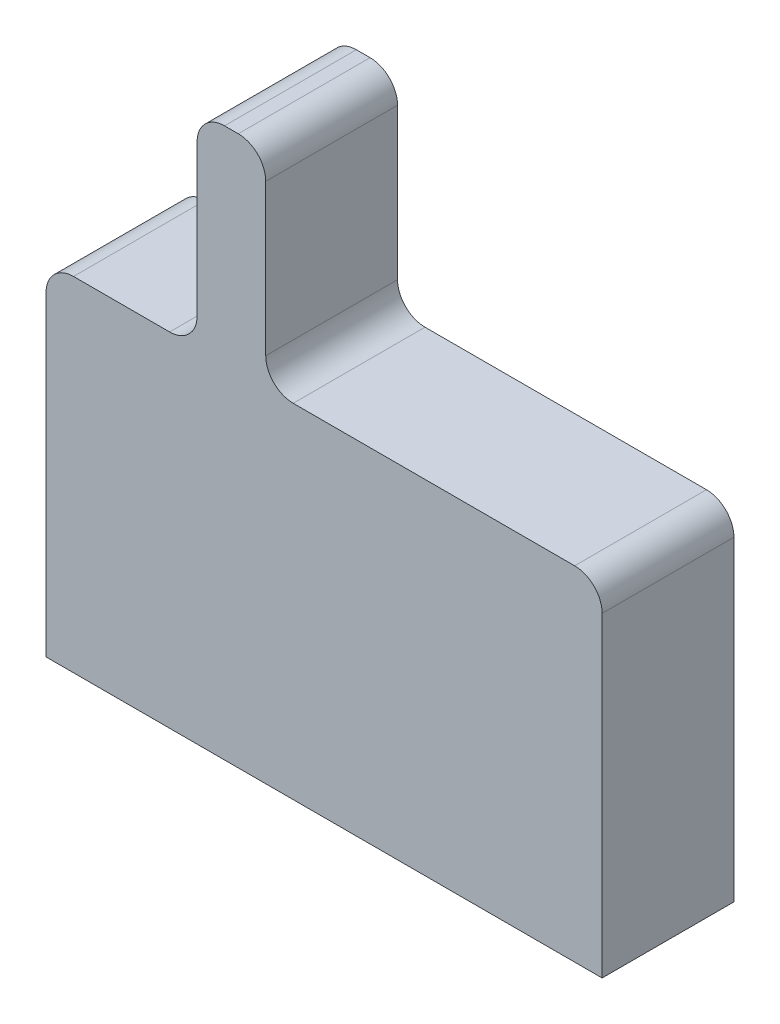
ISO-10303-21;
HEADER;
FILE_DESCRIPTION(('STEP AP214'),'2;1');
FILE_NAME('part.step','',(''),(''),'','','');
FILE_SCHEMA(('AUTOMOTIVE_DESIGN { 1 0 10303 214 1 1 1 1 }'));
ENDSEC;
DATA;
#1=APPLICATION_CONTEXT('core data for automotive mechanical design processes');
#2=APPLICATION_PROTOCOL_DEFINITION('international standard','automotive_design',2000,#1);
#3=PRODUCT_CONTEXT('',#1,'mechanical');
#4=PRODUCT('Part','Part','',(#3));
#5=PRODUCT_RELATED_PRODUCT_CATEGORY('part','',(#4));
#6=PRODUCT_DEFINITION_FORMATION('','',#4);
#7=PRODUCT_DEFINITION_CONTEXT('part definition',#1,'design');
#8=PRODUCT_DEFINITION('design','',#6,#7);
#9=PRODUCT_DEFINITION_SHAPE('','',#8);
#10=(LENGTH_UNIT() NAMED_UNIT(*) SI_UNIT(.MILLI.,.METRE.));
#11=(NAMED_UNIT(*) PLANE_ANGLE_UNIT() SI_UNIT($,.RADIAN.));
#12=(NAMED_UNIT(*) SI_UNIT($,.STERADIAN.) SOLID_ANGLE_UNIT());
#13=UNCERTAINTY_MEASURE_WITH_UNIT(LENGTH_MEASURE(1.E-05),#10,'distance_accuracy_value','');
#14=(GEOMETRIC_REPRESENTATION_CONTEXT(3) GLOBAL_UNCERTAINTY_ASSIGNED_CONTEXT((#13)) GLOBAL_UNIT_ASSIGNED_CONTEXT((#10,
#11,#12)) REPRESENTATION_CONTEXT('',''));
#15=CARTESIAN_POINT('',(0.,0.,0.));
#16=DIRECTION('',(0.,0.,1.));
#17=DIRECTION('',(1.,0.,0.));
#18=AXIS2_PLACEMENT_3D('',#15,#16,#17);
#19=CARTESIAN_POINT('',(2.025,1.25,0.96));
#20=DIRECTION('',(-1.,0.,0.));
#21=DIRECTION('',(0.,0.,1.));
#22=AXIS2_PLACEMENT_3D('',#19,#20,#21);
#23=PLANE('',#22);
#24=DIRECTION('',(0.,1.,0.));
#25=VECTOR('',#24,1.);
#26=CARTESIAN_POINT('',(2.025,1.25,0.));
#27=LINE('',#26,#25);
#28=CARTESIAN_POINT('',(2.025,-1.25,0.));
#29=VERTEX_POINT('',#28);
#30=CARTESIAN_POINT('',(2.025,1.05,0.));
#31=VERTEX_POINT('',#30);
#32=EDGE_CURVE('E162',#29,#31,#27,.T.);
#33=ORIENTED_EDGE('',*,*,#32,.T.);
#34=DIRECTION('',(0.,0.,-1.));
#35=VECTOR('',#34,1.);
#36=CARTESIAN_POINT('',(2.025,1.05,0.96));
#37=LINE('',#36,#35);
#38=CARTESIAN_POINT('',(2.025,1.05,0.96));
#39=VERTEX_POINT('',#38);
#40=EDGE_CURVE('E217',#31,#39,#37,.F.);
#41=ORIENTED_EDGE('',*,*,#40,.T.);
#42=DIRECTION('',(0.,1.,0.));
#43=VECTOR('',#42,1.);
#44=CARTESIAN_POINT('',(2.025,1.25,0.96));
#45=LINE('',#44,#43);
#46=CARTESIAN_POINT('',(2.025,-1.25,0.96));
#47=VERTEX_POINT('',#46);
#48=EDGE_CURVE('E181',#47,#39,#45,.T.);
#49=ORIENTED_EDGE('',*,*,#48,.F.);
#50=DIRECTION('',(0.,0.,-1.));
#51=VECTOR('',#50,1.);
#52=CARTESIAN_POINT('',(2.025,-1.25,0.96));
#53=LINE('',#52,#51);
#54=EDGE_CURVE('E153',#47,#29,#53,.T.);
#55=ORIENTED_EDGE('',*,*,#54,.T.);
#56=EDGE_LOOP('',(#33,#41,#49,#55));
#57=FACE_BOUND('',#56,.T.);
#58=ADVANCED_FACE('F33',(#57),#23,.F.);
#59=CARTESIAN_POINT('',(-0.424999999999999,1.25,0.96));
#60=DIRECTION('',(0.,-1.,0.));
#61=DIRECTION('',(1.,0.,0.));
#62=AXIS2_PLACEMENT_3D('',#59,#60,#61);
#63=PLANE('',#62);
#64=DIRECTION('',(-1.,0.,0.));
#65=VECTOR('',#64,1.);
#66=CARTESIAN_POINT('',(-0.424999999999999,1.25,0.96));
#67=LINE('',#66,#65);
#68=CARTESIAN_POINT('',(1.825,1.25,0.96));
#69=VERTEX_POINT('',#68);
#70=CARTESIAN_POINT('',(-0.225,1.25,0.96));
#71=VERTEX_POINT('',#70);
#72=EDGE_CURVE('E245',#69,#71,#67,.T.);
#73=ORIENTED_EDGE('',*,*,#72,.F.);
#74=DIRECTION('',(0.,0.,-1.));
#75=VECTOR('',#74,1.);
#76=CARTESIAN_POINT('',(1.825,1.25,0.96));
#77=LINE('',#76,#75);
#78=CARTESIAN_POINT('',(1.825,1.25,0.));
#79=VERTEX_POINT('',#78);
#80=EDGE_CURVE('E214',#69,#79,#77,.T.);
#81=ORIENTED_EDGE('',*,*,#80,.T.);
#82=DIRECTION('',(-1.,0.,0.));
#83=VECTOR('',#82,1.);
#84=CARTESIAN_POINT('',(-0.424999999999999,1.25,0.));
#85=LINE('',#84,#83);
#86=CARTESIAN_POINT('',(-0.225,1.25,0.));
#87=VERTEX_POINT('',#86);
#88=EDGE_CURVE('E165',#79,#87,#85,.T.);
#89=ORIENTED_EDGE('',*,*,#88,.T.);
#90=DIRECTION('',(0.,0.,-1.));
#91=VECTOR('',#90,1.);
#92=CARTESIAN_POINT('',(-0.225,1.25,0.96));
#93=LINE('',#92,#91);
#94=EDGE_CURVE('E212',#87,#71,#93,.F.);
#95=ORIENTED_EDGE('',*,*,#94,.T.);
#96=EDGE_LOOP('',(#73,#81,#89,#95));
#97=FACE_BOUND('',#96,.T.);
#98=ADVANCED_FACE('F238',(#97),#63,.F.);
#99=CARTESIAN_POINT('',(-0.425,2.75,0.96));
#100=DIRECTION('',(-1.,0.,0.));
#101=DIRECTION('',(0.,-1.,0.));
#102=AXIS2_PLACEMENT_3D('',#99,#100,#101);
#103=PLANE('',#102);
#104=DIRECTION('',(0.,1.,0.));
#105=VECTOR('',#104,1.);
#106=CARTESIAN_POINT('',(-0.425,2.75,0.));
#107=LINE('',#106,#105);
#108=CARTESIAN_POINT('',(-0.425,1.45,0.));
#109=VERTEX_POINT('',#108);
#110=CARTESIAN_POINT('',(-0.425,2.55,0.));
#111=VERTEX_POINT('',#110);
#112=EDGE_CURVE('E168',#109,#111,#107,.T.);
#113=ORIENTED_EDGE('',*,*,#112,.T.);
#114=DIRECTION('',(0.,0.,-1.));
#115=VECTOR('',#114,1.);
#116=CARTESIAN_POINT('',(-0.425,2.55,0.96));
#117=LINE('',#116,#115);
#118=CARTESIAN_POINT('',(-0.425,2.55,0.96));
#119=VERTEX_POINT('',#118);
#120=EDGE_CURVE('E198',#111,#119,#117,.F.);
#121=ORIENTED_EDGE('',*,*,#120,.T.);
#122=DIRECTION('',(0.,1.,0.));
#123=VECTOR('',#122,1.);
#124=CARTESIAN_POINT('',(-0.425,2.75,0.96));
#125=LINE('',#124,#123);
#126=CARTESIAN_POINT('',(-0.425,1.45,0.96));
#127=VERTEX_POINT('',#126);
#128=EDGE_CURVE('E243',#127,#119,#125,.T.);
#129=ORIENTED_EDGE('',*,*,#128,.F.);
#130=DIRECTION('',(0.,0.,-1.));
#131=VECTOR('',#130,1.);
#132=CARTESIAN_POINT('',(-0.425,1.45,0.));
#133=LINE('',#132,#131);
#134=EDGE_CURVE('E195',#127,#109,#133,.T.);
#135=ORIENTED_EDGE('',*,*,#134,.T.);
#136=EDGE_LOOP('',(#113,#121,#129,#135));
#137=FACE_BOUND('',#136,.T.);
#138=ADVANCED_FACE('F247',(#137),#103,.F.);
#139=CARTESIAN_POINT('',(-0.925,2.75,0.96));
#140=DIRECTION('',(0.,-1.,0.));
#141=DIRECTION('',(0.,0.,-1.));
#142=AXIS2_PLACEMENT_3D('',#139,#140,#141);
#143=PLANE('',#142);
#144=DIRECTION('',(-1.,0.,0.));
#145=VECTOR('',#144,1.);
#146=CARTESIAN_POINT('',(-0.925,2.75,0.96));
#147=LINE('',#146,#145);
#148=CARTESIAN_POINT('',(-0.625,2.75,0.96));
#149=VERTEX_POINT('',#148);
#150=CARTESIAN_POINT('',(-0.725,2.75,0.96));
#151=VERTEX_POINT('',#150);
#152=EDGE_CURVE('E249',#149,#151,#147,.T.);
#153=ORIENTED_EDGE('',*,*,#152,.F.);
#154=DIRECTION('',(0.,0.,-1.));
#155=VECTOR('',#154,1.);
#156=CARTESIAN_POINT('',(-0.625,2.75,0.96));
#157=LINE('',#156,#155);
#158=CARTESIAN_POINT('',(-0.625,2.75,0.));
#159=VERTEX_POINT('',#158);
#160=EDGE_CURVE('E184',#149,#159,#157,.T.);
#161=ORIENTED_EDGE('',*,*,#160,.T.);
#162=DIRECTION('',(-1.,0.,0.));
#163=VECTOR('',#162,1.);
#164=CARTESIAN_POINT('',(-0.925,2.75,0.));
#165=LINE('',#164,#163);
#166=CARTESIAN_POINT('',(-0.725,2.75,0.));
#167=VERTEX_POINT('',#166);
#168=EDGE_CURVE('E171',#159,#167,#165,.T.);
#169=ORIENTED_EDGE('',*,*,#168,.T.);
#170=DIRECTION('',(0.,0.,-1.));
#171=VECTOR('',#170,1.);
#172=CARTESIAN_POINT('',(-0.725,2.75,0.96));
#173=LINE('',#172,#171);
#174=EDGE_CURVE('E152',#167,#151,#173,.F.);
#175=ORIENTED_EDGE('',*,*,#174,.T.);
#176=EDGE_LOOP('',(#153,#161,#169,#175));
#177=FACE_BOUND('',#176,.T.);
#178=ADVANCED_FACE('F299',(#177),#143,.F.);
#179=CARTESIAN_POINT('',(-0.925,1.25,0.96));
#180=DIRECTION('',(1.,0.,0.));
#181=DIRECTION('',(0.,0.,-1.));
#182=AXIS2_PLACEMENT_3D('',#179,#180,#181);
#183=PLANE('',#182);
#184=DIRECTION('',(0.,-1.,0.));
#185=VECTOR('',#184,1.);
#186=CARTESIAN_POINT('',(-0.925,1.25,0.96));
#187=LINE('',#186,#185);
#188=CARTESIAN_POINT('',(-0.925,2.55,0.96));
#189=VERTEX_POINT('',#188);
#190=CARTESIAN_POINT('',(-0.925,1.45,0.96));
#191=VERTEX_POINT('',#190);
#192=EDGE_CURVE('E252',#189,#191,#187,.T.);
#193=ORIENTED_EDGE('',*,*,#192,.F.);
#194=DIRECTION('',(0.,0.,-1.));
#195=VECTOR('',#194,1.);
#196=CARTESIAN_POINT('',(-0.925,2.55,0.96));
#197=LINE('',#196,#195);
#198=CARTESIAN_POINT('',(-0.925,2.55,0.));
#199=VERTEX_POINT('',#198);
#200=EDGE_CURVE('E209',#189,#199,#197,.T.);
#201=ORIENTED_EDGE('',*,*,#200,.T.);
#202=DIRECTION('',(0.,-1.,0.));
#203=VECTOR('',#202,1.);
#204=CARTESIAN_POINT('',(-0.925,1.25,0.));
#205=LINE('',#204,#203);
#206=CARTESIAN_POINT('',(-0.925,1.45,0.));
#207=VERTEX_POINT('',#206);
#208=EDGE_CURVE('E174',#199,#207,#205,.T.);
#209=ORIENTED_EDGE('',*,*,#208,.T.);
#210=DIRECTION('',(0.,0.,-1.));
#211=VECTOR('',#210,1.);
#212=CARTESIAN_POINT('',(-0.925,1.45,0.96));
#213=LINE('',#212,#211);
#214=EDGE_CURVE('E207',#207,#191,#213,.F.);
#215=ORIENTED_EDGE('',*,*,#214,.T.);
#216=EDGE_LOOP('',(#193,#201,#209,#215));
#217=FACE_BOUND('',#216,.T.);
#218=ADVANCED_FACE('F304',(#217),#183,.F.);
#219=CARTESIAN_POINT('',(-2.025,1.25,0.96));
#220=DIRECTION('',(0.,-1.,0.));
#221=DIRECTION('',(1.,0.,0.));
#222=AXIS2_PLACEMENT_3D('',#219,#220,#221);
#223=PLANE('',#222);
#224=DIRECTION('',(-1.,0.,0.));
#225=VECTOR('',#224,1.);
#226=CARTESIAN_POINT('',(-2.025,1.25,0.));
#227=LINE('',#226,#225);
#228=CARTESIAN_POINT('',(-1.125,1.25,0.));
#229=VERTEX_POINT('',#228);
#230=CARTESIAN_POINT('',(-1.825,1.25,0.));
#231=VERTEX_POINT('',#230);
#232=EDGE_CURVE('E177',#229,#231,#227,.T.);
#233=ORIENTED_EDGE('',*,*,#232,.T.);
#234=DIRECTION('',(0.,0.,-1.));
#235=VECTOR('',#234,1.);
#236=CARTESIAN_POINT('',(-1.825,1.25,0.96));
#237=LINE('',#236,#235);
#238=CARTESIAN_POINT('',(-1.825,1.25,0.96));
#239=VERTEX_POINT('',#238);
#240=EDGE_CURVE('E56',#231,#239,#237,.F.);
#241=ORIENTED_EDGE('',*,*,#240,.T.);
#242=DIRECTION('',(-1.,0.,0.));
#243=VECTOR('',#242,1.);
#244=CARTESIAN_POINT('',(-2.025,1.25,0.96));
#245=LINE('',#244,#243);
#246=CARTESIAN_POINT('',(-1.125,1.25,0.96));
#247=VERTEX_POINT('',#246);
#248=EDGE_CURVE('E143',#247,#239,#245,.T.);
#249=ORIENTED_EDGE('',*,*,#248,.F.);
#250=DIRECTION('',(0.,0.,-1.));
#251=VECTOR('',#250,1.);
#252=CARTESIAN_POINT('',(-1.125,1.25,0.));
#253=LINE('',#252,#251);
#254=EDGE_CURVE('E221',#247,#229,#253,.T.);
#255=ORIENTED_EDGE('',*,*,#254,.T.);
#256=EDGE_LOOP('',(#233,#241,#249,#255));
#257=FACE_BOUND('',#256,.T.);
#258=ADVANCED_FACE('F308',(#257),#223,.F.);
#259=CARTESIAN_POINT('',(-2.025,1.25,0.96));
#260=DIRECTION('',(1.,0.,0.));
#261=DIRECTION('',(0.,1.,0.));
#262=AXIS2_PLACEMENT_3D('',#259,#260,#261);
#263=PLANE('',#262);
#264=DIRECTION('',(0.,-1.,0.));
#265=VECTOR('',#264,1.);
#266=CARTESIAN_POINT('',(-2.025,1.25,0.96));
#267=LINE('',#266,#265);
#268=CARTESIAN_POINT('',(-2.025,1.05,0.96));
#269=VERTEX_POINT('',#268);
#270=CARTESIAN_POINT('',(-2.025,-1.25,0.96));
#271=VERTEX_POINT('',#270);
#272=EDGE_CURVE('E132',#269,#271,#267,.T.);
#273=ORIENTED_EDGE('',*,*,#272,.F.);
#274=DIRECTION('',(0.,0.,-1.));
#275=VECTOR('',#274,1.);
#276=CARTESIAN_POINT('',(-2.025,1.05,0.96));
#277=LINE('',#276,#275);
#278=CARTESIAN_POINT('',(-2.025,1.05,0.));
#279=VERTEX_POINT('',#278);
#280=EDGE_CURVE('E219',#269,#279,#277,.T.);
#281=ORIENTED_EDGE('',*,*,#280,.T.);
#282=DIRECTION('',(0.,-1.,0.));
#283=VECTOR('',#282,1.);
#284=CARTESIAN_POINT('',(-2.025,1.25,0.));
#285=LINE('',#284,#283);
#286=CARTESIAN_POINT('',(-2.025,-1.25,0.));
#287=VERTEX_POINT('',#286);
#288=EDGE_CURVE('E149',#279,#287,#285,.T.);
#289=ORIENTED_EDGE('',*,*,#288,.T.);
#290=DIRECTION('',(0.,0.,-1.));
#291=VECTOR('',#290,1.);
#292=CARTESIAN_POINT('',(-2.025,-1.25,0.96));
#293=LINE('',#292,#291);
#294=EDGE_CURVE('E146',#271,#287,#293,.T.);
#295=ORIENTED_EDGE('',*,*,#294,.F.);
#296=EDGE_LOOP('',(#273,#281,#289,#295));
#297=FACE_BOUND('',#296,.T.);
#298=ADVANCED_FACE('F147',(#297),#263,.F.);
#299=CARTESIAN_POINT('',(-2.025,-1.25,0.96));
#300=DIRECTION('',(0.,1.,0.));
#301=DIRECTION('',(0.,0.,1.));
#302=AXIS2_PLACEMENT_3D('',#299,#300,#301);
#303=PLANE('',#302);
#304=DIRECTION('',(1.,0.,0.));
#305=VECTOR('',#304,1.);
#306=CARTESIAN_POINT('',(-2.025,-1.25,0.));
#307=LINE('',#306,#305);
#308=EDGE_CURVE('E180',#287,#29,#307,.T.);
#309=ORIENTED_EDGE('',*,*,#308,.T.);
#310=ORIENTED_EDGE('',*,*,#54,.F.);
#311=DIRECTION('',(1.,0.,0.));
#312=VECTOR('',#311,1.);
#313=CARTESIAN_POINT('',(-2.025,-1.25,0.96));
#314=LINE('',#313,#312);
#315=EDGE_CURVE('E138',#271,#47,#314,.T.);
#316=ORIENTED_EDGE('',*,*,#315,.F.);
#317=ORIENTED_EDGE('',*,*,#294,.T.);
#318=EDGE_LOOP('',(#309,#310,#316,#317));
#319=FACE_BOUND('',#318,.T.);
#320=ADVANCED_FACE('F155',(#319),#303,.F.);
#321=CARTESIAN_POINT('',(0.,0.,0.96));
#322=DIRECTION('',(0.,0.,1.));
#323=DIRECTION('',(1.,0.,0.));
#324=AXIS2_PLACEMENT_3D('',#321,#322,#323);
#325=PLANE('',#324);
#326=ORIENTED_EDGE('',*,*,#128,.T.);
#327=CARTESIAN_POINT('',(-0.625,2.55,0.96));
#328=DIRECTION('',(0.,0.,1.));
#329=DIRECTION('',(1.,0.,0.));
#330=AXIS2_PLACEMENT_3D('',#327,#328,#329);
#331=CIRCLE('',#330,0.2);
#332=EDGE_CURVE('E205',#119,#149,#331,.T.);
#333=ORIENTED_EDGE('',*,*,#332,.T.);
#334=ORIENTED_EDGE('',*,*,#152,.T.);
#335=CARTESIAN_POINT('',(-0.725,2.55,0.96));
#336=DIRECTION('',(0.,0.,1.));
#337=DIRECTION('',(1.,0.,0.));
#338=AXIS2_PLACEMENT_3D('',#335,#336,#337);
#339=CIRCLE('',#338,0.2);
#340=EDGE_CURVE('E203',#151,#189,#339,.T.);
#341=ORIENTED_EDGE('',*,*,#340,.T.);
#342=ORIENTED_EDGE('',*,*,#192,.T.);
#343=CARTESIAN_POINT('',(-1.125,1.45,0.96));
#344=DIRECTION('',(0.,0.,1.));
#345=DIRECTION('',(1.,0.,0.));
#346=AXIS2_PLACEMENT_3D('',#343,#344,#345);
#347=CIRCLE('',#346,0.2);
#348=EDGE_CURVE('E227',#191,#247,#347,.F.);
#349=ORIENTED_EDGE('',*,*,#348,.T.);
#350=ORIENTED_EDGE('',*,*,#248,.T.);
#351=CARTESIAN_POINT('',(-1.825,1.05,0.96));
#352=DIRECTION('',(0.,0.,1.));
#353=DIRECTION('',(1.,0.,0.));
#354=AXIS2_PLACEMENT_3D('',#351,#352,#353);
#355=CIRCLE('',#354,0.2);
#356=EDGE_CURVE('E48',#239,#269,#355,.T.);
#357=ORIENTED_EDGE('',*,*,#356,.T.);
#358=ORIENTED_EDGE('',*,*,#272,.T.);
#359=ORIENTED_EDGE('',*,*,#315,.T.);
#360=ORIENTED_EDGE('',*,*,#48,.T.);
#361=CARTESIAN_POINT('',(1.825,1.05,0.96));
#362=DIRECTION('',(0.,0.,1.));
#363=DIRECTION('',(1.,0.,0.));
#364=AXIS2_PLACEMENT_3D('',#361,#362,#363);
#365=CIRCLE('',#364,0.2);
#366=EDGE_CURVE('E201',#39,#69,#365,.T.);
#367=ORIENTED_EDGE('',*,*,#366,.T.);
#368=ORIENTED_EDGE('',*,*,#72,.T.);
#369=CARTESIAN_POINT('',(-0.225,1.45,0.96));
#370=DIRECTION('',(0.,0.,1.));
#371=DIRECTION('',(1.,0.,0.));
#372=AXIS2_PLACEMENT_3D('',#369,#370,#371);
#373=CIRCLE('',#372,0.2);
#374=EDGE_CURVE('E11',#71,#127,#373,.F.);
#375=ORIENTED_EDGE('',*,*,#374,.T.);
#376=EDGE_LOOP('',(#326,#333,#334,#341,#342,#349,#350,#357,#358,#359,#360,#367,#368,#375));
#377=FACE_BOUND('',#376,.T.);
#378=ADVANCED_FACE('F135',(#377),#325,.T.);
#379=CARTESIAN_POINT('',(0.,0.,0.));
#380=DIRECTION('',(0.,0.,1.));
#381=DIRECTION('',(1.,0.,0.));
#382=AXIS2_PLACEMENT_3D('',#379,#380,#381);
#383=PLANE('',#382);
#384=ORIENTED_EDGE('',*,*,#168,.F.);
#385=CARTESIAN_POINT('',(-0.625,2.55,0.));
#386=DIRECTION('',(0.,0.,1.));
#387=DIRECTION('',(1.,0.,0.));
#388=AXIS2_PLACEMENT_3D('',#385,#386,#387);
#389=CIRCLE('',#388,0.2);
#390=EDGE_CURVE('E193',#159,#111,#389,.F.);
#391=ORIENTED_EDGE('',*,*,#390,.T.);
#392=ORIENTED_EDGE('',*,*,#112,.F.);
#393=CARTESIAN_POINT('',(-0.225,1.45,0.));
#394=DIRECTION('',(0.,0.,1.));
#395=DIRECTION('',(1.,0.,0.));
#396=AXIS2_PLACEMENT_3D('',#393,#394,#395);
#397=CIRCLE('',#396,0.2);
#398=EDGE_CURVE('E41',#109,#87,#397,.T.);
#399=ORIENTED_EDGE('',*,*,#398,.T.);
#400=ORIENTED_EDGE('',*,*,#88,.F.);
#401=CARTESIAN_POINT('',(1.825,1.05,0.));
#402=DIRECTION('',(0.,0.,1.));
#403=DIRECTION('',(1.,0.,0.));
#404=AXIS2_PLACEMENT_3D('',#401,#402,#403);
#405=CIRCLE('',#404,0.2);
#406=EDGE_CURVE('E189',#79,#31,#405,.F.);
#407=ORIENTED_EDGE('',*,*,#406,.T.);
#408=ORIENTED_EDGE('',*,*,#32,.F.);
#409=ORIENTED_EDGE('',*,*,#308,.F.);
#410=ORIENTED_EDGE('',*,*,#288,.F.);
#411=CARTESIAN_POINT('',(-1.825,1.05,0.));
#412=DIRECTION('',(0.,0.,1.));
#413=DIRECTION('',(1.,0.,0.));
#414=AXIS2_PLACEMENT_3D('',#411,#412,#413);
#415=CIRCLE('',#414,0.2);
#416=EDGE_CURVE('E187',#279,#231,#415,.F.);
#417=ORIENTED_EDGE('',*,*,#416,.T.);
#418=ORIENTED_EDGE('',*,*,#232,.F.);
#419=CARTESIAN_POINT('',(-1.125,1.45,0.));
#420=DIRECTION('',(0.,0.,1.));
#421=DIRECTION('',(1.,0.,0.));
#422=AXIS2_PLACEMENT_3D('',#419,#420,#421);
#423=CIRCLE('',#422,0.2);
#424=EDGE_CURVE('E225',#229,#207,#423,.T.);
#425=ORIENTED_EDGE('',*,*,#424,.T.);
#426=ORIENTED_EDGE('',*,*,#208,.F.);
#427=CARTESIAN_POINT('',(-0.725,2.55,0.));
#428=DIRECTION('',(0.,0.,1.));
#429=DIRECTION('',(1.,0.,0.));
#430=AXIS2_PLACEMENT_3D('',#427,#428,#429);
#431=CIRCLE('',#430,0.2);
#432=EDGE_CURVE('E191',#199,#167,#431,.F.);
#433=ORIENTED_EDGE('',*,*,#432,.T.);
#434=EDGE_LOOP('',(#384,#391,#392,#399,#400,#407,#408,#409,#410,#417,#418,#425,#426,#433));
#435=FACE_BOUND('',#434,.T.);
#436=ADVANCED_FACE('F232',(#435),#383,.F.);
#437=CARTESIAN_POINT('',(-0.625,2.55,0.96));
#438=DIRECTION('',(0.,0.,-1.));
#439=DIRECTION('',(-1.,0.,0.));
#440=AXIS2_PLACEMENT_3D('',#437,#438,#439);
#441=CYLINDRICAL_SURFACE('',#440,0.2);
#442=ORIENTED_EDGE('',*,*,#332,.F.);
#443=ORIENTED_EDGE('',*,*,#120,.F.);
#444=ORIENTED_EDGE('',*,*,#390,.F.);
#445=ORIENTED_EDGE('',*,*,#160,.F.);
#446=EDGE_LOOP('',(#442,#443,#444,#445));
#447=FACE_BOUND('',#446,.T.);
#448=ADVANCED_FACE('F278',(#447),#441,.T.);
#449=CARTESIAN_POINT('',(-0.725,2.55,0.96));
#450=DIRECTION('',(0.,0.,-1.));
#451=DIRECTION('',(-1.,0.,0.));
#452=AXIS2_PLACEMENT_3D('',#449,#450,#451);
#453=CYLINDRICAL_SURFACE('',#452,0.2);
#454=ORIENTED_EDGE('',*,*,#340,.F.);
#455=ORIENTED_EDGE('',*,*,#174,.F.);
#456=ORIENTED_EDGE('',*,*,#432,.F.);
#457=ORIENTED_EDGE('',*,*,#200,.F.);
#458=EDGE_LOOP('',(#454,#455,#456,#457));
#459=FACE_BOUND('',#458,.T.);
#460=ADVANCED_FACE('F270',(#459),#453,.T.);
#461=CARTESIAN_POINT('',(1.825,1.05,0.96));
#462=DIRECTION('',(0.,0.,-1.));
#463=DIRECTION('',(-1.,0.,0.));
#464=AXIS2_PLACEMENT_3D('',#461,#462,#463);
#465=CYLINDRICAL_SURFACE('',#464,0.2);
#466=ORIENTED_EDGE('',*,*,#366,.F.);
#467=ORIENTED_EDGE('',*,*,#40,.F.);
#468=ORIENTED_EDGE('',*,*,#406,.F.);
#469=ORIENTED_EDGE('',*,*,#80,.F.);
#470=EDGE_LOOP('',(#466,#467,#468,#469));
#471=FACE_BOUND('',#470,.T.);
#472=ADVANCED_FACE('F268',(#471),#465,.T.);
#473=CARTESIAN_POINT('',(-1.825,1.05,0.96));
#474=DIRECTION('',(0.,0.,-1.));
#475=DIRECTION('',(-1.,0.,0.));
#476=AXIS2_PLACEMENT_3D('',#473,#474,#475);
#477=CYLINDRICAL_SURFACE('',#476,0.2);
#478=ORIENTED_EDGE('',*,*,#356,.F.);
#479=ORIENTED_EDGE('',*,*,#240,.F.);
#480=ORIENTED_EDGE('',*,*,#416,.F.);
#481=ORIENTED_EDGE('',*,*,#280,.F.);
#482=EDGE_LOOP('',(#478,#479,#480,#481));
#483=FACE_BOUND('',#482,.T.);
#484=ADVANCED_FACE('F261',(#483),#477,.T.);
#485=CARTESIAN_POINT('',(-1.125,1.45,0.96));
#486=DIRECTION('',(0.,0.,1.));
#487=DIRECTION('',(1.,0.,0.));
#488=AXIS2_PLACEMENT_3D('',#485,#486,#487);
#489=CYLINDRICAL_SURFACE('',#488,0.2);
#490=ORIENTED_EDGE('',*,*,#348,.F.);
#491=ORIENTED_EDGE('',*,*,#214,.F.);
#492=ORIENTED_EDGE('',*,*,#424,.F.);
#493=ORIENTED_EDGE('',*,*,#254,.F.);
#494=EDGE_LOOP('',(#490,#491,#492,#493));
#495=FACE_BOUND('',#494,.T.);
#496=ADVANCED_FACE('F276',(#495),#489,.F.);
#497=CARTESIAN_POINT('',(-0.225,1.45,0.96));
#498=DIRECTION('',(0.,0.,1.));
#499=DIRECTION('',(1.,0.,0.));
#500=AXIS2_PLACEMENT_3D('',#497,#498,#499);
#501=CYLINDRICAL_SURFACE('',#500,0.2);
#502=ORIENTED_EDGE('',*,*,#374,.F.);
#503=ORIENTED_EDGE('',*,*,#94,.F.);
#504=ORIENTED_EDGE('',*,*,#398,.F.);
#505=ORIENTED_EDGE('',*,*,#134,.F.);
#506=EDGE_LOOP('',(#502,#503,#504,#505));
#507=FACE_BOUND('',#506,.T.);
#508=ADVANCED_FACE('F35',(#507),#501,.F.);
#509=CLOSED_SHELL('',(#58,#98,#138,#178,#218,#258,#298,#320,#378,#436,#448,#460,#472,#484,#496,#508));
#510=MANIFOLD_SOLID_BREP('B2',#509);
#511=ADVANCED_BREP_SHAPE_REPRESENTATION('',(#18,#510),#14);
#512=SHAPE_DEFINITION_REPRESENTATION(#9,#511);
ENDSEC;
END-ISO-10303-21;
